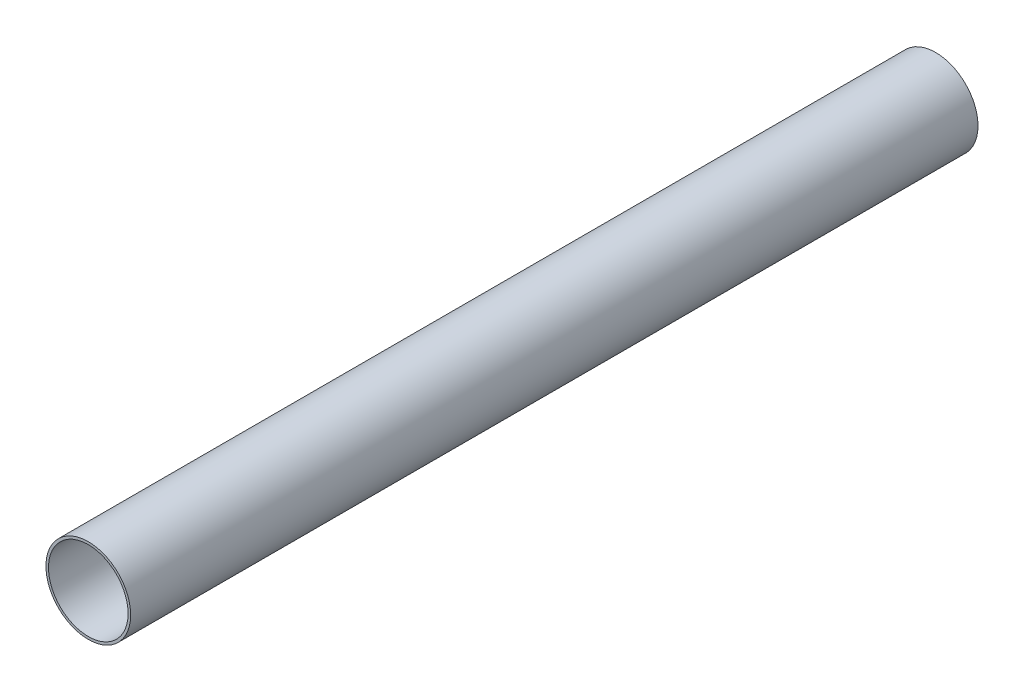
ISO-10303-21;
HEADER;
FILE_DESCRIPTION(('STEP AP214'),'2;1');
FILE_NAME('part.step','',(''),(''),'','','');
FILE_SCHEMA(('AUTOMOTIVE_DESIGN { 1 0 10303 214 1 1 1 1 }'));
ENDSEC;
DATA;
#1=APPLICATION_CONTEXT('core data for automotive mechanical design processes');
#2=APPLICATION_PROTOCOL_DEFINITION('international standard','automotive_design',2000,#1);
#3=PRODUCT_CONTEXT('',#1,'mechanical');
#4=PRODUCT('Part','Part','',(#3));
#5=PRODUCT_RELATED_PRODUCT_CATEGORY('part','',(#4));
#6=PRODUCT_DEFINITION_FORMATION('','',#4);
#7=PRODUCT_DEFINITION_CONTEXT('part definition',#1,'design');
#8=PRODUCT_DEFINITION('design','',#6,#7);
#9=PRODUCT_DEFINITION_SHAPE('','',#8);
#10=(LENGTH_UNIT() NAMED_UNIT(*) SI_UNIT(.MILLI.,.METRE.));
#11=(NAMED_UNIT(*) PLANE_ANGLE_UNIT() SI_UNIT($,.RADIAN.));
#12=(NAMED_UNIT(*) SI_UNIT($,.STERADIAN.) SOLID_ANGLE_UNIT());
#13=UNCERTAINTY_MEASURE_WITH_UNIT(LENGTH_MEASURE(1.E-05),#10,'distance_accuracy_value','');
#14=(GEOMETRIC_REPRESENTATION_CONTEXT(3) GLOBAL_UNCERTAINTY_ASSIGNED_CONTEXT((#13)) GLOBAL_UNIT_ASSIGNED_CONTEXT((#10,
#11,#12)) REPRESENTATION_CONTEXT('',''));
#15=CARTESIAN_POINT('',(0.,0.,0.));
#16=DIRECTION('',(0.,0.,1.));
#17=DIRECTION('',(1.,0.,0.));
#18=AXIS2_PLACEMENT_3D('',#15,#16,#17);
#19=CARTESIAN_POINT('',(0.,0.,500.));
#20=DIRECTION('',(0.,0.,1.));
#21=DIRECTION('',(1.,0.,0.));
#22=AXIS2_PLACEMENT_3D('',#19,#20,#21);
#23=PLANE('',#22);
#24=CARTESIAN_POINT('',(0.,0.,500.));
#25=DIRECTION('',(0.,0.,1.));
#26=DIRECTION('',(1.,0.,0.));
#27=AXIS2_PLACEMENT_3D('',#24,#25,#26);
#28=CIRCLE('',#27,25.);
#29=CARTESIAN_POINT('',(25.,0.,500.));
#30=VERTEX_POINT('',#29);
#31=EDGE_CURVE('E10',#30,#30,#28,.T.);
#32=ORIENTED_EDGE('',*,*,#31,.T.);
#33=EDGE_LOOP('',(#32));
#34=FACE_BOUND('',#33,.T.);
#35=CARTESIAN_POINT('',(0.,0.,500.));
#36=DIRECTION('',(0.,0.,1.));
#37=DIRECTION('',(1.,0.,0.));
#38=AXIS2_PLACEMENT_3D('',#35,#36,#37);
#39=CIRCLE('',#38,23.5);
#40=CARTESIAN_POINT('',(23.5,0.,500.));
#41=VERTEX_POINT('',#40);
#42=EDGE_CURVE('E47',#41,#41,#39,.T.);
#43=ORIENTED_EDGE('',*,*,#42,.F.);
#44=EDGE_LOOP('',(#43));
#45=FACE_BOUND('',#44,.T.);
#46=ADVANCED_FACE('F36',(#34,#45),#23,.T.);
#47=CARTESIAN_POINT('',(0.,0.,0.));
#48=DIRECTION('',(0.,0.,1.));
#49=DIRECTION('',(1.,0.,0.));
#50=AXIS2_PLACEMENT_3D('',#47,#48,#49);
#51=PLANE('',#50);
#52=CARTESIAN_POINT('',(0.,0.,0.));
#53=DIRECTION('',(0.,0.,1.));
#54=DIRECTION('',(1.,0.,0.));
#55=AXIS2_PLACEMENT_3D('',#52,#53,#54);
#56=CIRCLE('',#55,25.);
#57=CARTESIAN_POINT('',(25.,0.,0.));
#58=VERTEX_POINT('',#57);
#59=EDGE_CURVE('E40',#58,#58,#56,.T.);
#60=ORIENTED_EDGE('',*,*,#59,.F.);
#61=EDGE_LOOP('',(#60));
#62=FACE_BOUND('',#61,.T.);
#63=CARTESIAN_POINT('',(0.,0.,0.));
#64=DIRECTION('',(0.,0.,1.));
#65=DIRECTION('',(1.,0.,0.));
#66=AXIS2_PLACEMENT_3D('',#63,#64,#65);
#67=CIRCLE('',#66,23.5);
#68=CARTESIAN_POINT('',(23.5,0.,0.));
#69=VERTEX_POINT('',#68);
#70=EDGE_CURVE('E49',#69,#69,#67,.T.);
#71=ORIENTED_EDGE('',*,*,#70,.T.);
#72=EDGE_LOOP('',(#71));
#73=FACE_BOUND('',#72,.T.);
#74=ADVANCED_FACE('F59',(#62,#73),#51,.F.);
#75=CARTESIAN_POINT('',(0.,0.,500.));
#76=DIRECTION('',(0.,0.,-1.));
#77=DIRECTION('',(-1.,0.,0.));
#78=AXIS2_PLACEMENT_3D('',#75,#76,#77);
#79=CYLINDRICAL_SURFACE('',#78,25.);
#80=ORIENTED_EDGE('',*,*,#31,.F.);
#81=EDGE_LOOP('',(#80));
#82=FACE_BOUND('',#81,.T.);
#83=ORIENTED_EDGE('',*,*,#59,.T.);
#84=EDGE_LOOP('',(#83));
#85=FACE_BOUND('',#84,.T.);
#86=ADVANCED_FACE('F38',(#82,#85),#79,.T.);
#87=CARTESIAN_POINT('',(0.,0.,500.));
#88=DIRECTION('',(0.,0.,-1.));
#89=DIRECTION('',(-1.,0.,0.));
#90=AXIS2_PLACEMENT_3D('',#87,#88,#89);
#91=CYLINDRICAL_SURFACE('',#90,23.5);
#92=ORIENTED_EDGE('',*,*,#42,.T.);
#93=EDGE_LOOP('',(#92));
#94=FACE_BOUND('',#93,.T.);
#95=ORIENTED_EDGE('',*,*,#70,.F.);
#96=EDGE_LOOP('',(#95));
#97=FACE_BOUND('',#96,.T.);
#98=ADVANCED_FACE('F55',(#94,#97),#91,.F.);
#99=CLOSED_SHELL('',(#46,#74,#86,#98));
#100=MANIFOLD_SOLID_BREP('B2',#99);
#101=ADVANCED_BREP_SHAPE_REPRESENTATION('',(#18,#100),#14);
#102=SHAPE_DEFINITION_REPRESENTATION(#9,#101);
ENDSEC;
END-ISO-10303-21;
